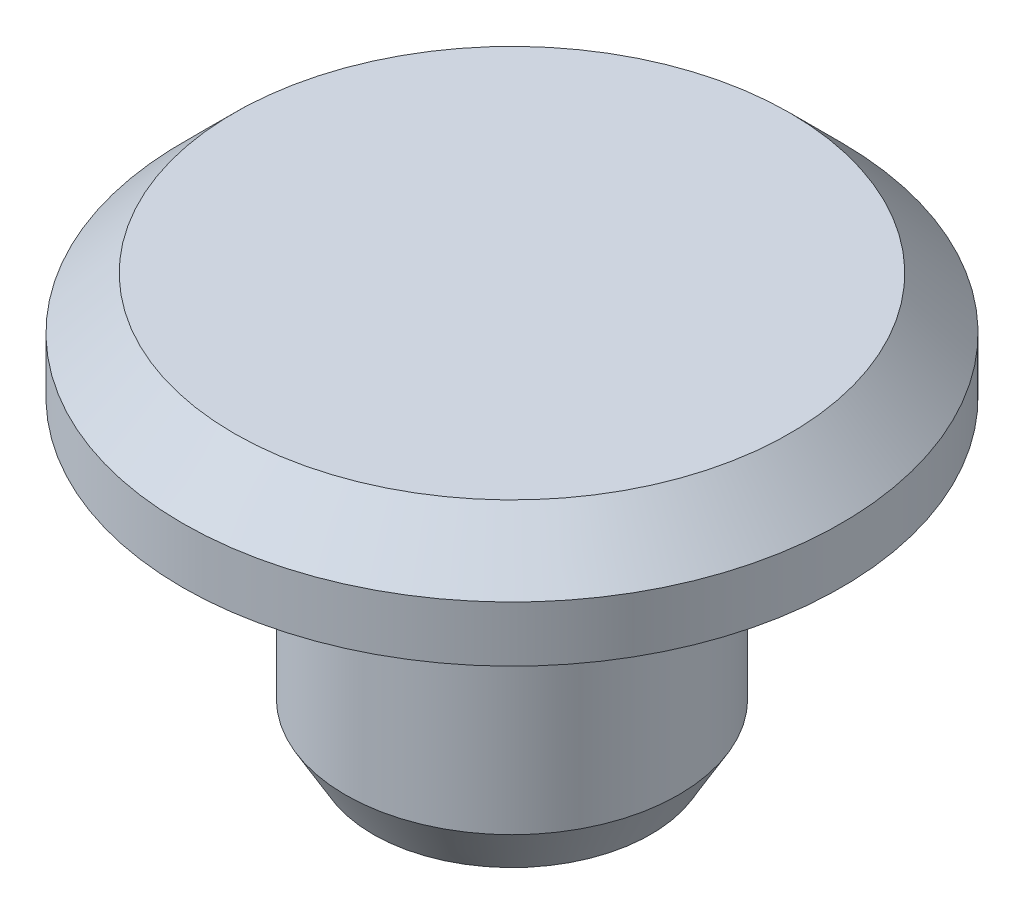
ISO-10303-21;
HEADER;
FILE_DESCRIPTION(('STEP AP214'),'2;1');
FILE_NAME('part.step','',(''),(''),'','','');
FILE_SCHEMA(('AUTOMOTIVE_DESIGN { 1 0 10303 214 1 1 1 1 }'));
ENDSEC;
DATA;
#1=APPLICATION_CONTEXT('core data for automotive mechanical design processes');
#2=APPLICATION_PROTOCOL_DEFINITION('international standard','automotive_design',2000,#1);
#3=PRODUCT_CONTEXT('',#1,'mechanical');
#4=PRODUCT('Part','Part','',(#3));
#5=PRODUCT_RELATED_PRODUCT_CATEGORY('part','',(#4));
#6=PRODUCT_DEFINITION_FORMATION('','',#4);
#7=PRODUCT_DEFINITION_CONTEXT('part definition',#1,'design');
#8=PRODUCT_DEFINITION('design','',#6,#7);
#9=PRODUCT_DEFINITION_SHAPE('','',#8);
#10=(LENGTH_UNIT() NAMED_UNIT(*) SI_UNIT(.MILLI.,.METRE.));
#11=(NAMED_UNIT(*) PLANE_ANGLE_UNIT() SI_UNIT($,.RADIAN.));
#12=(NAMED_UNIT(*) SI_UNIT($,.STERADIAN.) SOLID_ANGLE_UNIT());
#13=UNCERTAINTY_MEASURE_WITH_UNIT(LENGTH_MEASURE(1.E-05),#10,'distance_accuracy_value','');
#14=(GEOMETRIC_REPRESENTATION_CONTEXT(3) GLOBAL_UNCERTAINTY_ASSIGNED_CONTEXT((#13)) GLOBAL_UNIT_ASSIGNED_CONTEXT((#10,
#11,#12)) REPRESENTATION_CONTEXT('',''));
#15=CARTESIAN_POINT('',(0.,0.,0.));
#16=DIRECTION('',(0.,0.,1.));
#17=DIRECTION('',(1.,0.,0.));
#18=AXIS2_PLACEMENT_3D('',#15,#16,#17);
#19=CARTESIAN_POINT('',(-2.99999999999999,0.,0.));
#20=DIRECTION('',(0.,-1.,0.));
#21=DIRECTION('',(0.,0.,-1.));
#22=AXIS2_PLACEMENT_3D('',#19,#20,#21);
#23=PLANE('',#22);
#24=CARTESIAN_POINT('',(0.,0.,0.));
#25=DIRECTION('',(0.,-1.,0.));
#26=DIRECTION('',(0.,0.,-1.));
#27=AXIS2_PLACEMENT_3D('',#24,#25,#26);
#28=CIRCLE('',#27,2.49999999999999);
#29=CARTESIAN_POINT('',(0.,0.,-2.49999999999999));
#30=VERTEX_POINT('',#29);
#31=EDGE_CURVE('E11',#30,#30,#28,.T.);
#32=ORIENTED_EDGE('',*,*,#31,.T.);
#33=EDGE_LOOP('',(#32));
#34=FACE_BOUND('',#33,.T.);
#35=CARTESIAN_POINT('',(0.,0.,0.));
#36=DIRECTION('',(0.,-1.,0.));
#37=DIRECTION('',(0.,0.,1.));
#38=AXIS2_PLACEMENT_3D('',#35,#36,#37);
#39=CIRCLE('',#38,2.25000000000001);
#40=CARTESIAN_POINT('',(1.75,0.,1.4142135623731));
#41=VERTEX_POINT('',#40);
#42=CARTESIAN_POINT('',(-1.75,0.,1.4142135623731));
#43=VERTEX_POINT('',#42);
#44=EDGE_CURVE('E64',#41,#43,#39,.T.);
#45=ORIENTED_EDGE('',*,*,#44,.F.);
#46=DIRECTION('',(0.,0.,1.));
#47=VECTOR('',#46,1.);
#48=CARTESIAN_POINT('',(1.75,0.,-1.4142135623731));
#49=LINE('',#48,#47);
#50=CARTESIAN_POINT('',(1.75,0.,-1.4142135623731));
#51=VERTEX_POINT('',#50);
#52=EDGE_CURVE('E119',#51,#41,#49,.T.);
#53=ORIENTED_EDGE('',*,*,#52,.F.);
#54=CARTESIAN_POINT('',(0.,0.,0.));
#55=DIRECTION('',(0.,-1.,0.));
#56=DIRECTION('',(0.,0.,-1.));
#57=AXIS2_PLACEMENT_3D('',#54,#55,#56);
#58=CIRCLE('',#57,2.25000000000001);
#59=CARTESIAN_POINT('',(-1.75,0.,-1.4142135623731));
#60=VERTEX_POINT('',#59);
#61=EDGE_CURVE('E128',#60,#51,#58,.T.);
#62=ORIENTED_EDGE('',*,*,#61,.F.);
#63=DIRECTION('',(0.,0.,-1.));
#64=VECTOR('',#63,1.);
#65=CARTESIAN_POINT('',(-1.75,0.,1.4142135623731));
#66=LINE('',#65,#64);
#67=EDGE_CURVE('E99',#43,#60,#66,.T.);
#68=ORIENTED_EDGE('',*,*,#67,.F.);
#69=EDGE_LOOP('',(#45,#53,#62,#68));
#70=FACE_BOUND('',#69,.T.);
#71=ADVANCED_FACE('F47',(#34,#70),#23,.T.);
#72=CARTESIAN_POINT('',(0.,7.5,0.));
#73=DIRECTION('',(0.,1.,0.));
#74=DIRECTION('',(0.,0.,1.));
#75=AXIS2_PLACEMENT_3D('',#72,#73,#74);
#76=PLANE('',#75);
#77=CARTESIAN_POINT('',(0.,7.5,0.));
#78=DIRECTION('',(0.,1.,0.));
#79=DIRECTION('',(0.,0.,1.));
#80=AXIS2_PLACEMENT_3D('',#77,#78,#79);
#81=CIRCLE('',#80,5.);
#82=CARTESIAN_POINT('',(0.,7.5,5.));
#83=VERTEX_POINT('',#82);
#84=EDGE_CURVE('E151',#83,#83,#81,.T.);
#85=ORIENTED_EDGE('',*,*,#84,.T.);
#86=EDGE_LOOP('',(#85));
#87=FACE_BOUND('',#86,.T.);
#88=ADVANCED_FACE('F169',(#87),#76,.T.);
#89=CARTESIAN_POINT('',(0.,7.5,0.));
#90=DIRECTION('',(0.,-1.,0.));
#91=DIRECTION('',(0.,0.,-1.));
#92=AXIS2_PLACEMENT_3D('',#89,#90,#91);
#93=CONICAL_SURFACE('',#92,5.,0.785398163397446);
#94=CARTESIAN_POINT('',(0.,6.56738468368999,0.));
#95=DIRECTION('',(0.,1.,0.));
#96=DIRECTION('',(0.,0.,1.));
#97=AXIS2_PLACEMENT_3D('',#94,#95,#96);
#98=CIRCLE('',#97,5.93261531631);
#99=CARTESIAN_POINT('',(0.,6.56738468368999,5.93261531631));
#100=VERTEX_POINT('',#99);
#101=EDGE_CURVE('E147',#100,#100,#98,.T.);
#102=ORIENTED_EDGE('',*,*,#101,.T.);
#103=EDGE_LOOP('',(#102));
#104=FACE_BOUND('',#103,.T.);
#105=ORIENTED_EDGE('',*,*,#84,.F.);
#106=EDGE_LOOP('',(#105));
#107=FACE_BOUND('',#106,.T.);
#108=ADVANCED_FACE('F174',(#104,#107),#93,.T.);
#109=CARTESIAN_POINT('',(0.,14.,0.));
#110=DIRECTION('',(0.,1.,0.));
#111=DIRECTION('',(0.,0.,1.));
#112=AXIS2_PLACEMENT_3D('',#109,#110,#111);
#113=CYLINDRICAL_SURFACE('',#112,5.93261531631);
#114=CARTESIAN_POINT('',(0.,5.56738468368999,0.));
#115=DIRECTION('',(0.,1.,0.));
#116=DIRECTION('',(0.,0.,1.));
#117=AXIS2_PLACEMENT_3D('',#114,#115,#116);
#118=CIRCLE('',#117,5.93261531631);
#119=CARTESIAN_POINT('',(0.,5.56738468368999,5.93261531631));
#120=VERTEX_POINT('',#119);
#121=EDGE_CURVE('E143',#120,#120,#118,.T.);
#122=ORIENTED_EDGE('',*,*,#121,.T.);
#123=EDGE_LOOP('',(#122));
#124=FACE_BOUND('',#123,.T.);
#125=ORIENTED_EDGE('',*,*,#101,.F.);
#126=EDGE_LOOP('',(#125));
#127=FACE_BOUND('',#126,.T.);
#128=ADVANCED_FACE('F181',(#124,#127),#113,.T.);
#129=CARTESIAN_POINT('',(0.,5.56738468368999,0.));
#130=DIRECTION('',(0.,1.,0.));
#131=DIRECTION('',(0.,0.,1.));
#132=AXIS2_PLACEMENT_3D('',#129,#130,#131);
#133=CONICAL_SURFACE('',#132,5.93261531631,1.22173047639603);
#134=CARTESIAN_POINT('',(0.,4.5,0.));
#135=DIRECTION('',(0.,1.,0.));
#136=DIRECTION('',(0.,0.,1.));
#137=AXIS2_PLACEMENT_3D('',#134,#135,#136);
#138=CIRCLE('',#137,3.);
#139=CARTESIAN_POINT('',(0.,4.5,3.));
#140=VERTEX_POINT('',#139);
#141=EDGE_CURVE('E135',#140,#140,#138,.T.);
#142=ORIENTED_EDGE('',*,*,#141,.T.);
#143=EDGE_LOOP('',(#142));
#144=FACE_BOUND('',#143,.T.);
#145=ORIENTED_EDGE('',*,*,#121,.F.);
#146=EDGE_LOOP('',(#145));
#147=FACE_BOUND('',#146,.T.);
#148=ADVANCED_FACE('F185',(#144,#147),#133,.T.);
#149=CARTESIAN_POINT('',(0.,14.,0.));
#150=DIRECTION('',(0.,1.,0.));
#151=DIRECTION('',(0.,0.,1.));
#152=AXIS2_PLACEMENT_3D('',#149,#150,#151);
#153=CYLINDRICAL_SURFACE('',#152,2.99999999999999);
#154=CARTESIAN_POINT('',(0.,0.866025403784448,0.));
#155=DIRECTION('',(0.,-1.,0.));
#156=DIRECTION('',(0.,0.,-1.));
#157=AXIS2_PLACEMENT_3D('',#154,#155,#156);
#158=CIRCLE('',#157,2.99999999999999);
#159=CARTESIAN_POINT('',(0.,0.866025403784448,-2.99999999999999));
#160=VERTEX_POINT('',#159);
#161=EDGE_CURVE('E57',#160,#160,#158,.F.);
#162=ORIENTED_EDGE('',*,*,#161,.T.);
#163=EDGE_LOOP('',(#162));
#164=FACE_BOUND('',#163,.T.);
#165=ORIENTED_EDGE('',*,*,#141,.F.);
#166=EDGE_LOOP('',(#165));
#167=FACE_BOUND('',#166,.T.);
#168=ADVANCED_FACE('F158',(#164,#167),#153,.T.);
#169=CARTESIAN_POINT('',(0.,5.5,0.));
#170=DIRECTION('',(0.,-1.,0.));
#171=DIRECTION('',(0.,0.,-1.));
#172=AXIS2_PLACEMENT_3D('',#169,#170,#171);
#173=CYLINDRICAL_SURFACE('',#172,2.25000000000001);
#174=ORIENTED_EDGE('',*,*,#44,.T.);
#175=DIRECTION('',(0.,-1.,0.));
#176=VECTOR('',#175,1.);
#177=CARTESIAN_POINT('',(-1.75,5.5,1.4142135623731));
#178=LINE('',#177,#176);
#179=CARTESIAN_POINT('',(-1.75,5.5,1.4142135623731));
#180=VERTEX_POINT('',#179);
#181=EDGE_CURVE('E87',#180,#43,#178,.T.);
#182=ORIENTED_EDGE('',*,*,#181,.F.);
#183=CARTESIAN_POINT('',(0.,5.5,0.));
#184=DIRECTION('',(0.,-1.,0.));
#185=DIRECTION('',(0.,0.,1.));
#186=AXIS2_PLACEMENT_3D('',#183,#184,#185);
#187=CIRCLE('',#186,2.25000000000001);
#188=CARTESIAN_POINT('',(1.75,5.5,1.4142135623731));
#189=VERTEX_POINT('',#188);
#190=EDGE_CURVE('E115',#189,#180,#187,.T.);
#191=ORIENTED_EDGE('',*,*,#190,.F.);
#192=DIRECTION('',(0.,-1.,0.));
#193=VECTOR('',#192,1.);
#194=CARTESIAN_POINT('',(1.75,5.5,1.4142135623731));
#195=LINE('',#194,#193);
#196=EDGE_CURVE('E72',#189,#41,#195,.T.);
#197=ORIENTED_EDGE('',*,*,#196,.T.);
#198=EDGE_LOOP('',(#174,#182,#191,#197));
#199=FACE_BOUND('',#198,.T.);
#200=ADVANCED_FACE('F192',(#199),#173,.F.);
#201=CARTESIAN_POINT('',(1.75,5.5,-1.4142135623731));
#202=DIRECTION('',(1.,0.,0.));
#203=DIRECTION('',(0.,0.,-1.));
#204=AXIS2_PLACEMENT_3D('',#201,#202,#203);
#205=PLANE('',#204);
#206=ORIENTED_EDGE('',*,*,#52,.T.);
#207=ORIENTED_EDGE('',*,*,#196,.F.);
#208=DIRECTION('',(0.,0.,1.));
#209=VECTOR('',#208,1.);
#210=CARTESIAN_POINT('',(1.75,5.5,-1.4142135623731));
#211=LINE('',#210,#209);
#212=CARTESIAN_POINT('',(1.75,5.5,-1.4142135623731));
#213=VERTEX_POINT('',#212);
#214=EDGE_CURVE('E112',#213,#189,#211,.T.);
#215=ORIENTED_EDGE('',*,*,#214,.F.);
#216=DIRECTION('',(0.,-1.,0.));
#217=VECTOR('',#216,1.);
#218=CARTESIAN_POINT('',(1.75,5.5,-1.4142135623731));
#219=LINE('',#218,#217);
#220=EDGE_CURVE('E104',#213,#51,#219,.T.);
#221=ORIENTED_EDGE('',*,*,#220,.T.);
#222=EDGE_LOOP('',(#206,#207,#215,#221));
#223=FACE_BOUND('',#222,.T.);
#224=ADVANCED_FACE('F195',(#223),#205,.F.);
#225=CARTESIAN_POINT('',(0.,5.5,0.));
#226=DIRECTION('',(0.,-1.,0.));
#227=DIRECTION('',(0.,0.,-1.));
#228=AXIS2_PLACEMENT_3D('',#225,#226,#227);
#229=CYLINDRICAL_SURFACE('',#228,2.25000000000001);
#230=ORIENTED_EDGE('',*,*,#61,.T.);
#231=ORIENTED_EDGE('',*,*,#220,.F.);
#232=CARTESIAN_POINT('',(0.,5.5,0.));
#233=DIRECTION('',(0.,-1.,0.));
#234=DIRECTION('',(0.,0.,-1.));
#235=AXIS2_PLACEMENT_3D('',#232,#233,#234);
#236=CIRCLE('',#235,2.25000000000001);
#237=CARTESIAN_POINT('',(-1.75,5.5,-1.4142135623731));
#238=VERTEX_POINT('',#237);
#239=EDGE_CURVE('E107',#238,#213,#236,.T.);
#240=ORIENTED_EDGE('',*,*,#239,.F.);
#241=DIRECTION('',(0.,-1.,0.));
#242=VECTOR('',#241,1.);
#243=CARTESIAN_POINT('',(-1.75,5.5,-1.4142135623731));
#244=LINE('',#243,#242);
#245=EDGE_CURVE('E92',#238,#60,#244,.T.);
#246=ORIENTED_EDGE('',*,*,#245,.T.);
#247=EDGE_LOOP('',(#230,#231,#240,#246));
#248=FACE_BOUND('',#247,.T.);
#249=ADVANCED_FACE('F108',(#248),#229,.F.);
#250=CARTESIAN_POINT('',(-1.75,5.5,1.4142135623731));
#251=DIRECTION('',(-1.,0.,0.));
#252=DIRECTION('',(0.,0.,1.));
#253=AXIS2_PLACEMENT_3D('',#250,#251,#252);
#254=PLANE('',#253);
#255=ORIENTED_EDGE('',*,*,#67,.T.);
#256=ORIENTED_EDGE('',*,*,#245,.F.);
#257=DIRECTION('',(0.,0.,-1.));
#258=VECTOR('',#257,1.);
#259=CARTESIAN_POINT('',(-1.75,5.5,1.4142135623731));
#260=LINE('',#259,#258);
#261=EDGE_CURVE('E96',#180,#238,#260,.T.);
#262=ORIENTED_EDGE('',*,*,#261,.F.);
#263=ORIENTED_EDGE('',*,*,#181,.T.);
#264=EDGE_LOOP('',(#255,#256,#262,#263));
#265=FACE_BOUND('',#264,.T.);
#266=ADVANCED_FACE('F94',(#265),#254,.F.);
#267=CARTESIAN_POINT('',(0.,5.5,0.));
#268=DIRECTION('',(0.,1.,0.));
#269=DIRECTION('',(0.,0.,1.));
#270=AXIS2_PLACEMENT_3D('',#267,#268,#269);
#271=PLANE('',#270);
#272=ORIENTED_EDGE('',*,*,#190,.T.);
#273=ORIENTED_EDGE('',*,*,#261,.T.);
#274=ORIENTED_EDGE('',*,*,#239,.T.);
#275=ORIENTED_EDGE('',*,*,#214,.T.);
#276=EDGE_LOOP('',(#272,#273,#274,#275));
#277=FACE_BOUND('',#276,.T.);
#278=ADVANCED_FACE('F114',(#277),#271,.F.);
#279=CARTESIAN_POINT('',(0.,0.866025403784448,0.));
#280=DIRECTION('',(0.,1.,0.));
#281=DIRECTION('',(0.,0.,1.));
#282=AXIS2_PLACEMENT_3D('',#279,#280,#281);
#283=CONICAL_SURFACE('',#282,2.99999999999999,0.523598775598299);
#284=ORIENTED_EDGE('',*,*,#31,.F.);
#285=EDGE_LOOP('',(#284));
#286=FACE_BOUND('',#285,.T.);
#287=ORIENTED_EDGE('',*,*,#161,.F.);
#288=EDGE_LOOP('',(#287));
#289=FACE_BOUND('',#288,.T.);
#290=ADVANCED_FACE('F50',(#286,#289),#283,.T.);
#291=CLOSED_SHELL('',(#71,#88,#108,#128,#148,#168,#200,#224,#249,#266,#278,#290));
#292=MANIFOLD_SOLID_BREP('B2',#291);
#293=ADVANCED_BREP_SHAPE_REPRESENTATION('',(#18,#292),#14);
#294=SHAPE_DEFINITION_REPRESENTATION(#9,#293);
ENDSEC;
END-ISO-10303-21;
